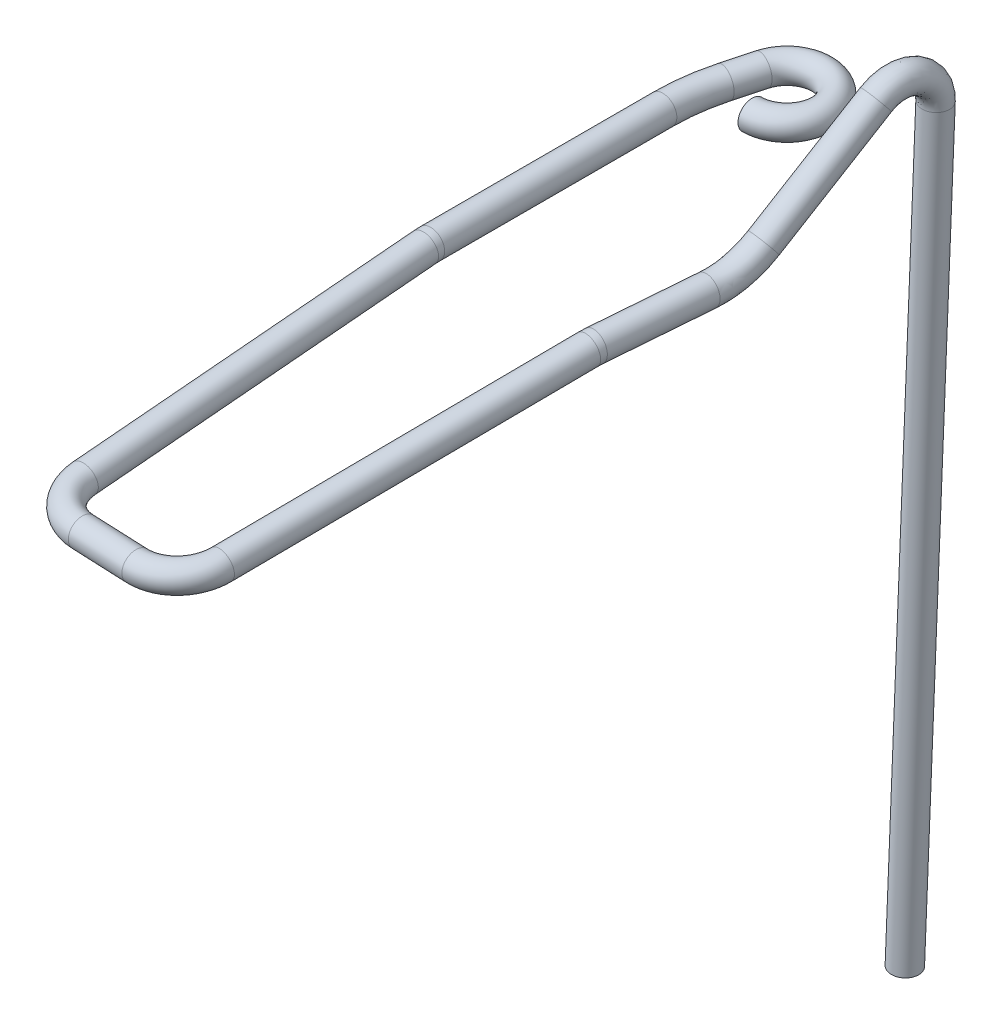
ISO-10303-21;
HEADER;
FILE_DESCRIPTION(('STEP AP214'),'2;1');
FILE_NAME('part.step','',(''),(''),'','','');
FILE_SCHEMA(('AUTOMOTIVE_DESIGN { 1 0 10303 214 1 1 1 1 }'));
ENDSEC;
DATA;
#1=APPLICATION_CONTEXT('core data for automotive mechanical design processes');
#2=APPLICATION_PROTOCOL_DEFINITION('international standard','automotive_design',2000,#1);
#3=PRODUCT_CONTEXT('',#1,'mechanical');
#4=PRODUCT('Part','Part','',(#3));
#5=PRODUCT_RELATED_PRODUCT_CATEGORY('part','',(#4));
#6=PRODUCT_DEFINITION_FORMATION('','',#4);
#7=PRODUCT_DEFINITION_CONTEXT('part definition',#1,'design');
#8=PRODUCT_DEFINITION('design','',#6,#7);
#9=PRODUCT_DEFINITION_SHAPE('','',#8);
#10=(LENGTH_UNIT() NAMED_UNIT(*) SI_UNIT(.MILLI.,.METRE.));
#11=(NAMED_UNIT(*) PLANE_ANGLE_UNIT() SI_UNIT($,.RADIAN.));
#12=(NAMED_UNIT(*) SI_UNIT($,.STERADIAN.) SOLID_ANGLE_UNIT());
#13=UNCERTAINTY_MEASURE_WITH_UNIT(LENGTH_MEASURE(1.E-05),#10,'distance_accuracy_value','');
#14=(GEOMETRIC_REPRESENTATION_CONTEXT(3) GLOBAL_UNCERTAINTY_ASSIGNED_CONTEXT((#13)) GLOBAL_UNIT_ASSIGNED_CONTEXT((#10,
#11,#12)) REPRESENTATION_CONTEXT('',''));
#15=CARTESIAN_POINT('',(0.,0.,0.));
#16=DIRECTION('',(0.,0.,1.));
#17=DIRECTION('',(1.,0.,0.));
#18=AXIS2_PLACEMENT_3D('',#15,#16,#17);
#19=CARTESIAN_POINT('',(-3.5,0.,5.37770702741135));
#20=DIRECTION('',(0.,0.,1.));
#21=DIRECTION('',(1.,0.,0.));
#22=AXIS2_PLACEMENT_3D('',#19,#20,#21);
#23=CYLINDRICAL_SURFACE('',#22,1.);
#24=CARTESIAN_POINT('',(-3.5,0.,5.37770702741135));
#25=DIRECTION('',(0.,0.,1.));
#26=DIRECTION('',(1.,0.,0.));
#27=AXIS2_PLACEMENT_3D('',#24,#25,#26);
#28=CIRCLE('',#27,1.);
#29=CARTESIAN_POINT('',(-4.5,0.,5.37770702741136));
#30=VERTEX_POINT('',#29);
#31=EDGE_CURVE('E37',#30,#30,#28,.T.);
#32=ORIENTED_EDGE('',*,*,#31,.T.);
#33=EDGE_LOOP('',(#32));
#34=FACE_BOUND('',#33,.T.);
#35=CARTESIAN_POINT('',(-3.5,0.,22.));
#36=DIRECTION('',(0.,0.,1.));
#37=DIRECTION('',(1.,0.,0.));
#38=AXIS2_PLACEMENT_3D('',#35,#36,#37);
#39=CIRCLE('',#38,1.);
#40=CARTESIAN_POINT('',(-3.5,0.999999999999951,22.));
#41=VERTEX_POINT('',#40);
#42=EDGE_CURVE('E10',#41,#41,#39,.T.);
#43=ORIENTED_EDGE('',*,*,#42,.F.);
#44=EDGE_LOOP('',(#43));
#45=FACE_BOUND('',#44,.T.);
#46=ADVANCED_FACE('F30',(#34,#45),#23,.T.);
#47=CARTESIAN_POINT('',(11.5,0.,5.37770702741132));
#48=DIRECTION('',(0.,1.,0.));
#49=DIRECTION('',(0.,0.,1.));
#50=AXIS2_PLACEMENT_3D('',#47,#48,#49);
#51=TOROIDAL_SURFACE('',#50,15.,1.);
#52=CARTESIAN_POINT('',(-2.98888739433603,0.,1.49542135087353));
#53=DIRECTION('',(-0.258819045102508,0.,0.965925826289072));
#54=DIRECTION('',(0.965925826289072,0.,0.258819045102508));
#55=AXIS2_PLACEMENT_3D('',#52,#53,#54);
#56=CIRCLE('',#55,1.);
#57=CARTESIAN_POINT('',(-3.9548132206251,0.,1.23660230577102));
#58=VERTEX_POINT('',#57);
#59=EDGE_CURVE('E42',#58,#58,#56,.T.);
#60=CARTESIAN_POINT('',(11.5,0.,5.37770702741132));
#61=DIRECTION('',(0.,1.,0.));
#62=DIRECTION('',(0.,0.,1.));
#63=AXIS2_PLACEMENT_3D('',#60,#61,#62);
#64=CIRCLE('',#63,16.);
#65=EDGE_CURVE('',#58,#30,#64,.T.);
#66=ORIENTED_EDGE('',*,*,#59,.T.);
#67=ORIENTED_EDGE('',*,*,#31,.F.);
#68=ORIENTED_EDGE('',*,*,#65,.T.);
#69=ORIENTED_EDGE('',*,*,#65,.F.);
#70=EDGE_LOOP('',(#66,#68,#67,#69));
#71=FACE_BOUND('',#70,.T.);
#72=ADVANCED_FACE('F109',(#71),#51,.T.);
#73=CARTESIAN_POINT('',(-2.41481456572268,0.,-0.647047612756269));
#74=DIRECTION('',(-0.258819045102522,0.,0.965925826289068));
#75=DIRECTION('',(0.965925826289068,0.,0.258819045102522));
#76=AXIS2_PLACEMENT_3D('',#73,#74,#75);
#77=CYLINDRICAL_SURFACE('',#76,1.);
#78=CARTESIAN_POINT('',(-2.41481456572268,0.,-0.647047612756269));
#79=DIRECTION('',(-0.258819045102508,0.,0.965925826289072));
#80=DIRECTION('',(0.965925826289072,0.,0.258819045102508));
#81=AXIS2_PLACEMENT_3D('',#78,#79,#80);
#82=CIRCLE('',#81,1.);
#83=CARTESIAN_POINT('',(-3.38074039201175,0.,-0.905866657858777));
#84=VERTEX_POINT('',#83);
#85=EDGE_CURVE('E123',#84,#84,#82,.T.);
#86=ORIENTED_EDGE('',*,*,#85,.T.);
#87=EDGE_LOOP('',(#86));
#88=FACE_BOUND('',#87,.T.);
#89=ORIENTED_EDGE('',*,*,#59,.F.);
#90=EDGE_LOOP('',(#89));
#91=FACE_BOUND('',#90,.T.);
#92=ADVANCED_FACE('F106',(#88,#91),#77,.T.);
#93=CARTESIAN_POINT('',(0.,0.,0.));
#94=DIRECTION('',(0.,-1.,0.));
#95=DIRECTION('',(0.,0.,-1.));
#96=AXIS2_PLACEMENT_3D('',#93,#94,#95);
#97=TOROIDAL_SURFACE('',#96,2.5,1.);
#98=CARTESIAN_POINT('',(0.,0.,2.5));
#99=DIRECTION('',(1.,0.,0.));
#100=DIRECTION('',(0.,0.,-1.));
#101=AXIS2_PLACEMENT_3D('',#98,#99,#100);
#102=CIRCLE('',#101,1.);
#103=CARTESIAN_POINT('',(0.,0.,3.5));
#104=VERTEX_POINT('',#103);
#105=EDGE_CURVE('E125',#104,#104,#102,.T.);
#106=CARTESIAN_POINT('',(0.,0.,0.));
#107=DIRECTION('',(0.,-1.,0.));
#108=DIRECTION('',(0.,0.,-1.));
#109=AXIS2_PLACEMENT_3D('',#106,#107,#108);
#110=CIRCLE('',#109,3.5);
#111=EDGE_CURVE('',#84,#104,#110,.T.);
#112=ORIENTED_EDGE('',*,*,#85,.F.);
#113=ORIENTED_EDGE('',*,*,#105,.T.);
#114=ORIENTED_EDGE('',*,*,#111,.T.);
#115=ORIENTED_EDGE('',*,*,#111,.F.);
#116=EDGE_LOOP('',(#112,#114,#113,#115));
#117=FACE_BOUND('',#116,.T.);
#118=ADVANCED_FACE('F102',(#117),#97,.T.);
#119=CARTESIAN_POINT('',(0.,0.,2.5));
#120=DIRECTION('',(1.,0.,0.));
#121=DIRECTION('',(0.,0.,-1.));
#122=AXIS2_PLACEMENT_3D('',#119,#120,#121);
#123=PLANE('',#122);
#124=ORIENTED_EDGE('',*,*,#105,.F.);
#125=EDGE_LOOP('',(#124));
#126=FACE_BOUND('',#125,.T.);
#127=ADVANCED_FACE('F98',(#126),#123,.F.);
#128=CARTESIAN_POINT('',(-3.5,-0.0190265095412711,22.4357787137383));
#129=DIRECTION('',(0.,-0.0871557427476583,0.996194698091746));
#130=DIRECTION('',(0.,-0.996194698091746,-0.0871557427476583));
#131=AXIS2_PLACEMENT_3D('',#128,#129,#130);
#132=CYLINDRICAL_SURFACE('',#131,0.999999999999951);
#133=CARTESIAN_POINT('',(-3.5,-0.0190265095412711,22.4357787137383));
#134=DIRECTION('',(0.,-0.0871557427476584,0.996194698091746));
#135=DIRECTION('',(1.,0.,0.));
#136=AXIS2_PLACEMENT_3D('',#133,#134,#135);
#137=CIRCLE('',#136,0.999999999999951);
#138=CARTESIAN_POINT('',(-3.5,0.977168188550426,22.5229344564859));
#139=VERTEX_POINT('',#138);
#140=EDGE_CURVE('E49',#139,#139,#137,.T.);
#141=ORIENTED_EDGE('',*,*,#140,.T.);
#142=EDGE_LOOP('',(#141));
#143=FACE_BOUND('',#142,.T.);
#144=CARTESIAN_POINT('',(-3.5,-2.15065315116584,46.8003827174666));
#145=DIRECTION('',(0.,-0.0871557427476584,0.996194698091746));
#146=DIRECTION('',(1.,0.,0.));
#147=AXIS2_PLACEMENT_3D('',#144,#145,#146);
#148=CIRCLE('',#147,0.999999999999951);
#149=CARTESIAN_POINT('',(-4.5,-2.15065315116584,46.8003827174666));
#150=VERTEX_POINT('',#149);
#151=EDGE_CURVE('E130',#150,#150,#148,.T.);
#152=ORIENTED_EDGE('',*,*,#151,.F.);
#153=EDGE_LOOP('',(#152));
#154=FACE_BOUND('',#153,.T.);
#155=ADVANCED_FACE('F94',(#143,#154),#132,.T.);
#156=CARTESIAN_POINT('',(-3.5,-5.,22.));
#157=DIRECTION('',(-1.,0.,0.));
#158=DIRECTION('',(0.,0.,1.));
#159=AXIS2_PLACEMENT_3D('',#156,#157,#158);
#160=TOROIDAL_SURFACE('',#159,5.,0.999999999999951);
#161=CARTESIAN_POINT('',(-3.5,-5.,22.));
#162=DIRECTION('',(-1.,0.,0.));
#163=DIRECTION('',(0.,0.,1.));
#164=AXIS2_PLACEMENT_3D('',#161,#162,#163);
#165=CIRCLE('',#164,5.99999999999995);
#166=EDGE_CURVE('',#139,#41,#165,.T.);
#167=ORIENTED_EDGE('',*,*,#140,.F.);
#168=ORIENTED_EDGE('',*,*,#42,.T.);
#169=ORIENTED_EDGE('',*,*,#166,.T.);
#170=ORIENTED_EDGE('',*,*,#166,.F.);
#171=EDGE_LOOP('',(#167,#169,#168,#170));
#172=FACE_BOUND('',#171,.T.);
#173=ADVANCED_FACE('F90',(#172),#160,.T.);
#174=CARTESIAN_POINT('',(3.61801430436533,-2.16428093634913,46.9561490148824));
#175=DIRECTION('',(0.,0.996194698091746,0.0871557427476585));
#176=DIRECTION('',(0.,-0.0871557427476585,0.996194698091746));
#177=AXIS2_PLACEMENT_3D('',#174,#175,#176);
#178=TOROIDAL_SURFACE('',#177,3.12301894226448,1.);
#179=CARTESIAN_POINT('',(3.49445982661464,-2.4362568743494,50.064848211318));
#180=DIRECTION('',(0.99921709731111,-0.00344810021240211,0.0394119657729198));
#181=DIRECTION('',(0.,-0.996194698091746,-0.0871557427476585));
#182=AXIS2_PLACEMENT_3D('',#179,#180,#181);
#183=CIRCLE('',#182,1.);
#184=CARTESIAN_POINT('',(3.49445982661464,-3.43245157244115,49.9776924685704));
#185=VERTEX_POINT('',#184);
#186=EDGE_CURVE('E50',#185,#185,#183,.T.);
#187=ORIENTED_EDGE('',*,*,#186,.T.);
#188=EDGE_LOOP('',(#187));
#189=FACE_BOUND('',#188,.T.);
#190=CARTESIAN_POINT('',(6.73110724053769,-2.18596497766224,47.2039987412265));
#191=DIRECTION('',(-0.079665373996572,-0.0868787324414548,0.993028455803434));
#192=DIRECTION('',(0.,-0.996194698091745,-0.0871557427476584));
#193=AXIS2_PLACEMENT_3D('',#190,#191,#192);
#194=CIRCLE('',#193,1.);
#195=CARTESIAN_POINT('',(6.73110724053769,-3.18215967575399,47.1168429984788));
#196=VERTEX_POINT('',#195);
#197=EDGE_CURVE('E46',#196,#196,#194,.F.);
#198=ORIENTED_EDGE('',*,*,#197,.F.);
#199=EDGE_LOOP('',(#198));
#200=FACE_BOUND('',#199,.T.);
#201=ADVANCED_FACE('F86',(#189,#200),#178,.T.);
#202=CARTESIAN_POINT('',(-0.502348708066688,-2.42246468004603,49.9072027090606));
#203=DIRECTION('',(0.99921709731111,-0.00344810021240232,0.0394119657729206));
#204=DIRECTION('',(0.0394122000672257,0.,-0.999223037407496));
#205=AXIS2_PLACEMENT_3D('',#202,#203,#204);
#206=CYLINDRICAL_SURFACE('',#205,1.);
#207=CARTESIAN_POINT('',(-0.502348708066688,-2.42246468004603,49.9072027090606));
#208=DIRECTION('',(0.99921709731111,-0.00344810021240211,0.0394119657729198));
#209=DIRECTION('',(0.,-0.996194698091746,-0.0871557427476585));
#210=AXIS2_PLACEMENT_3D('',#207,#208,#209);
#211=CIRCLE('',#210,1.);
#212=CARTESIAN_POINT('',(-0.541911221146131,-2.50955218832834,50.9026174836446));
#213=VERTEX_POINT('',#212);
#214=EDGE_CURVE('E54',#213,#213,#211,.T.);
#215=ORIENTED_EDGE('',*,*,#214,.T.);
#216=EDGE_LOOP('',(#215));
#217=FACE_BOUND('',#216,.T.);
#218=ORIENTED_EDGE('',*,*,#186,.F.);
#219=EDGE_LOOP('',(#218));
#220=FACE_BOUND('',#219,.T.);
#221=ADVANCED_FACE('F82',(#217,#220),#206,.T.);
#222=CARTESIAN_POINT('',(-0.378868918845874,-2.15065315116585,46.8003827174666));
#223=DIRECTION('',(0.,-0.996194698091746,-0.0871557427476585));
#224=DIRECTION('',(0.,0.0871557427476585,-0.996194698091746));
#225=AXIS2_PLACEMENT_3D('',#222,#223,#224);
#226=TOROIDAL_SURFACE('',#225,3.12113108115413,1.);
#227=CARTESIAN_POINT('',(-0.378868918845874,-2.15065315116585,46.8003827174666));
#228=DIRECTION('',(0.,-0.996194698091746,-0.0871557427476585));
#229=DIRECTION('',(0.,0.0871557427476585,-0.996194698091746));
#230=AXIS2_PLACEMENT_3D('',#227,#228,#229);
#231=CIRCLE('',#230,4.12113108115413);
#232=EDGE_CURVE('',#213,#150,#231,.T.);
#233=ORIENTED_EDGE('',*,*,#214,.F.);
#234=ORIENTED_EDGE('',*,*,#151,.T.);
#235=ORIENTED_EDGE('',*,*,#232,.T.);
#236=ORIENTED_EDGE('',*,*,#232,.F.);
#237=EDGE_LOOP('',(#233,#235,#234,#236));
#238=FACE_BOUND('',#237,.T.);
#239=ADVANCED_FACE('F78',(#238),#226,.T.);
#240=CARTESIAN_POINT('',(8.71430693400654,0.,22.4854545965875));
#241=DIRECTION('',(0.0793520774998861,-0.00172514026707717,-0.996845159333941));
#242=DIRECTION('',(0.00705830081993865,0.999974406946396,-0.00116869231984529));
#243=AXIS2_PLACEMENT_3D('',#240,#241,#242);
#244=CIRCLE('',#243,1.);
#245=DIRECTION('',(0.0793641362663767,0.,-0.996845692108208));
#246=VECTOR('',#245,1.);
#247=SURFACE_OF_LINEAR_EXTRUSION('',#244,#246);
#248=CARTESIAN_POINT('',(8.72136523482648,0.9999744069464,22.4842859042677));
#249=VERTEX_POINT('',#248);
#250=EDGE_CURVE('E55',#249,#249,#244,.T.);
#251=ORIENTED_EDGE('',*,*,#250,.T.);
#252=EDGE_LOOP('',(#251));
#253=FACE_BOUND('',#252,.T.);
#254=CARTESIAN_POINT('',(9.30953795600437,0.,15.009111905776));
#255=DIRECTION('',(0.0793520774998861,-0.00172514026707682,-0.996845159333942));
#256=DIRECTION('',(-0.996846642697148,0.,-0.0793521955803633));
#257=AXIS2_PLACEMENT_3D('',#254,#255,#256);
#258=CIRCLE('',#257,1.00000000000001);
#259=CARTESIAN_POINT('',(8.31269131330721,0.,14.9297597101956));
#260=VERTEX_POINT('',#259);
#261=EDGE_CURVE('E52',#260,#260,#258,.T.);
#262=ORIENTED_EDGE('',*,*,#261,.F.);
#263=EDGE_LOOP('',(#262));
#264=FACE_BOUND('',#263,.T.);
#265=ADVANCED_FACE('F73',(#253,#264),#247,.T.);
#266=CARTESIAN_POINT('',(8.67901277995795,-0.019662805116115,22.9270431921967));
#267=DIRECTION('',(0.0796653739965656,0.086878732441455,-0.993028455803434));
#268=DIRECTION('',(0.,0.996194698091746,0.0871557427476586));
#269=AXIS2_PLACEMENT_3D('',#266,#267,#268);
#270=CIRCLE('',#269,1.);
#271=CARTESIAN_POINT('',(8.67969996624541,-4.99987947518922,22.4826993535976));
#272=DIRECTION('',(-0.996821663180525,0.00694329484194074,-0.0793622231968754));
#273=AXIS1_PLACEMENT('',#271,#272);
#274=SURFACE_OF_REVOLUTION('',#270,#273);
#275=CARTESIAN_POINT('',(8.67901277995795,0.976531892975633,23.0141989349444));
#276=VERTEX_POINT('',#275);
#277=EDGE_CURVE('E61',#276,#276,#270,.T.);
#278=ORIENTED_EDGE('',*,*,#277,.T.);
#279=EDGE_LOOP('',(#278));
#280=FACE_BOUND('',#279,.T.);
#281=ORIENTED_EDGE('',*,*,#250,.F.);
#282=EDGE_LOOP('',(#281));
#283=FACE_BOUND('',#282,.T.);
#284=ADVANCED_FACE('F77',(#280,#283),#274,.F.);
#285=DIRECTION('',(-0.0796652554443469,-0.0885972201695649,0.992876618544929));
#286=VECTOR('',#285,1.);
#287=SURFACE_OF_LINEAR_EXTRUSION('',#270,#286);
#288=ORIENTED_EDGE('',*,*,#277,.F.);
#289=EDGE_LOOP('',(#288));
#290=FACE_BOUND('',#289,.T.);
#291=ORIENTED_EDGE('',*,*,#197,.T.);
#292=EDGE_LOOP('',(#291));
#293=FACE_BOUND('',#292,.T.);
#294=ADVANCED_FACE('F140',(#290,#293),#287,.F.);
#295=CARTESIAN_POINT('',(10.7174089919377,4.99524110790934,0.0737355991664006));
#296=DIRECTION('',(-0.0435555362407903,-0.99904949521549,-0.0017382095531886));
#297=DIRECTION('',(-0.998410336786931,0.0435898384339461,-0.0357312941594571));
#298=AXIS2_PLACEMENT_3D('',#295,#296,#297);
#299=CIRCLE('',#298,1.00000000000001);
#300=DIRECTION('',(-0.0434817983875383,-0.999048221581858,-0.00346181500271865));
#301=VECTOR('',#300,1.);
#302=SURFACE_OF_LINEAR_EXTRUSION('',#299,#301);
#303=CARTESIAN_POINT('',(9.71899865515077,5.03883094634329,0.0380043050069433));
#304=VERTEX_POINT('',#303);
#305=EDGE_CURVE('E157',#304,#304,#299,.T.);
#306=ORIENTED_EDGE('',*,*,#305,.T.);
#307=EDGE_LOOP('',(#306));
#308=FACE_BOUND('',#307,.T.);
#309=CARTESIAN_POINT('',(8.3259100806231,-49.9524110790928,-0.116664225983125));
#310=DIRECTION('',(-0.0435555362407903,-0.99904949521549,-0.0017382095531886));
#311=DIRECTION('',(-0.998410336786931,0.0435898384339461,-0.0357312941594571));
#312=AXIS2_PLACEMENT_3D('',#309,#310,#311);
#313=CIRCLE('',#312,1.00000000000001);
#314=CARTESIAN_POINT('',(7.32749974383616,-49.9088212406589,-0.152395520142583));
#315=VERTEX_POINT('',#314);
#316=EDGE_CURVE('E66',#315,#315,#313,.T.);
#317=ORIENTED_EDGE('',*,*,#316,.F.);
#318=EDGE_LOOP('',(#317));
#319=FACE_BOUND('',#318,.T.);
#320=ADVANCED_FACE('F142',(#308,#319),#302,.T.);
#321=CARTESIAN_POINT('',(10.4821129065512,6.96068671294284,4.11040899485944));
#322=DIRECTION('',(0.0893723880575561,0.615099465952966,-0.783367872226878));
#323=DIRECTION('',(-0.994306538680699,0.00927787387020494,-0.106152852968051));
#324=AXIS2_PLACEMENT_3D('',#321,#322,#323);
#325=CIRCLE('',#324,1.00000000000001);
#326=CARTESIAN_POINT('',(10.5189986512717,4.99524110790929,2.56584982943692));
#327=DIRECTION('',(-0.995896915892241,0.0436193873653399,-0.0792885991943033));
#328=AXIS1_PLACEMENT('',#326,#327);
#329=SURFACE_OF_REVOLUTION('',#325,#328);
#330=CARTESIAN_POINT('',(9.48780636787048,6.96996458681304,4.00425614189139));
#331=VERTEX_POINT('',#330);
#332=EDGE_CURVE('E160',#331,#331,#325,.T.);
#333=ORIENTED_EDGE('',*,*,#332,.T.);
#334=EDGE_LOOP('',(#333));
#335=FACE_BOUND('',#334,.T.);
#336=ORIENTED_EDGE('',*,*,#305,.F.);
#337=EDGE_LOOP('',(#336));
#338=FACE_BOUND('',#337,.T.);
#339=ADVANCED_FACE('F148',(#335,#338),#329,.F.);
#340=CARTESIAN_POINT('',(9.65895453365897,1.27721987741051,11.3229407987783));
#341=DIRECTION('',(0.0893723880575561,0.615099465952966,-0.783367872226878));
#342=DIRECTION('',(-0.994306538680699,0.00927787387020494,-0.106152852968051));
#343=AXIS2_PLACEMENT_3D('',#340,#341,#342);
#344=CIRCLE('',#343,1.00000000000001);
#345=DIRECTION('',(0.0892840613443849,0.616458531314588,-0.782308913127872));
#346=VECTOR('',#345,1.);
#347=SURFACE_OF_LINEAR_EXTRUSION('',#344,#346);
#348=CARTESIAN_POINT('',(8.66464799497826,1.28649775128072,11.2167879458103));
#349=VERTEX_POINT('',#348);
#350=EDGE_CURVE('E185',#349,#349,#344,.T.);
#351=ORIENTED_EDGE('',*,*,#350,.T.);
#352=EDGE_LOOP('',(#351));
#353=FACE_BOUND('',#352,.T.);
#354=ORIENTED_EDGE('',*,*,#332,.F.);
#355=EDGE_LOOP('',(#354));
#356=FACE_BOUND('',#355,.T.);
#357=ADVANCED_FACE('F171',(#353,#356),#347,.T.);
#358=CARTESIAN_POINT('',(9.57042874632958,5.99428932949114,15.0298827957922));
#359=DIRECTION('',(-0.995896915892241,0.0436193873653399,-0.0792885991943033));
#360=AXIS1_PLACEMENT('',#358,#359);
#361=SURFACE_OF_REVOLUTION('',#344,#360);
#362=ORIENTED_EDGE('',*,*,#350,.F.);
#363=EDGE_LOOP('',(#362));
#364=FACE_BOUND('',#363,.T.);
#365=ORIENTED_EDGE('',*,*,#261,.T.);
#366=EDGE_LOOP('',(#365));
#367=FACE_BOUND('',#366,.T.);
#368=ADVANCED_FACE('F169',(#364,#367),#361,.T.);
#369=CARTESIAN_POINT('',(8.3259100806231,-49.9524110790928,-0.116664225983125));
#370=DIRECTION('',(-0.0435555362407903,-0.99904949521549,-0.0017382095531886));
#371=DIRECTION('',(-0.998410336786931,0.0435898384339461,-0.0357312941594571));
#372=AXIS2_PLACEMENT_3D('',#369,#370,#371);
#373=PLANE('',#372);
#374=ORIENTED_EDGE('',*,*,#316,.T.);
#375=EDGE_LOOP('',(#374));
#376=FACE_BOUND('',#375,.T.);
#377=ADVANCED_FACE('F166',(#376),#373,.T.);
#378=CLOSED_SHELL('',(#46,#72,#92,#118,#127,#155,#173,#201,#221,#239,#265,#284,#294,#320,#339,
#357,#368,#377));
#379=MANIFOLD_SOLID_BREP('B2',#378);
#380=ADVANCED_BREP_SHAPE_REPRESENTATION('',(#18,#379),#14);
#381=SHAPE_DEFINITION_REPRESENTATION(#9,#380);
ENDSEC;
END-ISO-10303-21;
